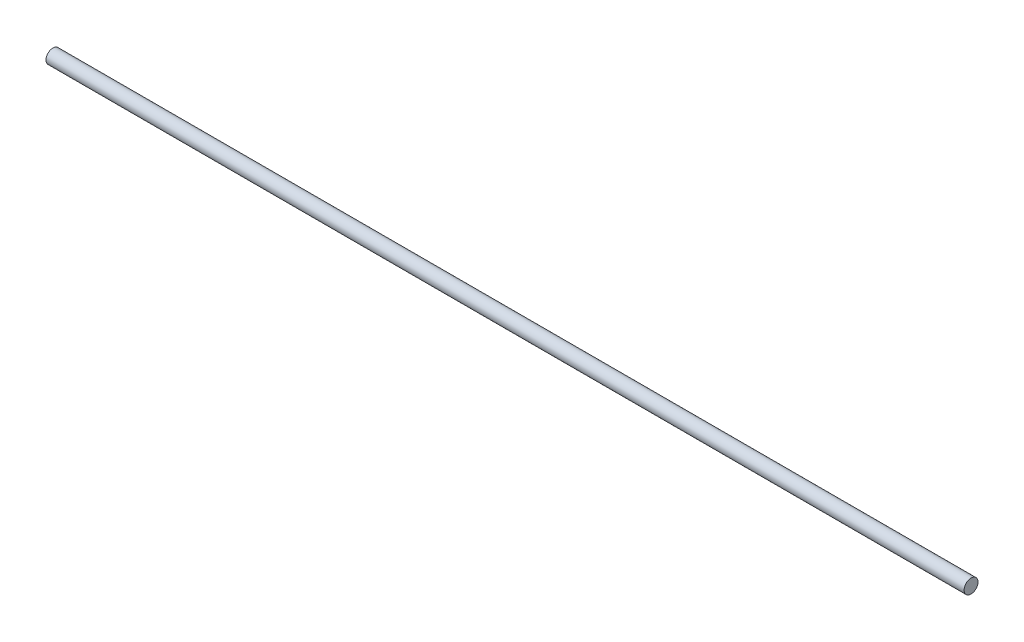
ISO-10303-21;
HEADER;
FILE_DESCRIPTION(('STEP AP214'),'2;1');
FILE_NAME('part.step','',(''),(''),'','','');
FILE_SCHEMA(('AUTOMOTIVE_DESIGN { 1 0 10303 214 1 1 1 1 }'));
ENDSEC;
DATA;
#1=APPLICATION_CONTEXT('core data for automotive mechanical design processes');
#2=APPLICATION_PROTOCOL_DEFINITION('international standard','automotive_design',2000,#1);
#3=PRODUCT_CONTEXT('',#1,'mechanical');
#4=PRODUCT('Part','Part','',(#3));
#5=PRODUCT_RELATED_PRODUCT_CATEGORY('part','',(#4));
#6=PRODUCT_DEFINITION_FORMATION('','',#4);
#7=PRODUCT_DEFINITION_CONTEXT('part definition',#1,'design');
#8=PRODUCT_DEFINITION('design','',#6,#7);
#9=PRODUCT_DEFINITION_SHAPE('','',#8);
#10=(LENGTH_UNIT() NAMED_UNIT(*) SI_UNIT(.MILLI.,.METRE.));
#11=(NAMED_UNIT(*) PLANE_ANGLE_UNIT() SI_UNIT($,.RADIAN.));
#12=(NAMED_UNIT(*) SI_UNIT($,.STERADIAN.) SOLID_ANGLE_UNIT());
#13=UNCERTAINTY_MEASURE_WITH_UNIT(LENGTH_MEASURE(1.E-05),#10,'distance_accuracy_value','');
#14=(GEOMETRIC_REPRESENTATION_CONTEXT(3) GLOBAL_UNCERTAINTY_ASSIGNED_CONTEXT((#13)) GLOBAL_UNIT_ASSIGNED_CONTEXT((#10,
#11,#12)) REPRESENTATION_CONTEXT('',''));
#15=CARTESIAN_POINT('',(0.,0.,0.));
#16=DIRECTION('',(0.,0.,1.));
#17=DIRECTION('',(1.,0.,0.));
#18=AXIS2_PLACEMENT_3D('',#15,#16,#17);
#19=CARTESIAN_POINT('',(-278.062338091003,0.117111756098624,0.));
#20=DIRECTION('',(1.,0.,0.));
#21=DIRECTION('',(0.,0.,-1.));
#22=AXIS2_PLACEMENT_3D('',#19,#20,#21);
#23=CYLINDRICAL_SURFACE('',#22,2.);
#24=CARTESIAN_POINT('',(-278.062338091003,0.117111756098624,0.));
#25=DIRECTION('',(1.,0.,0.));
#26=DIRECTION('',(0.,0.,-1.));
#27=AXIS2_PLACEMENT_3D('',#24,#25,#26);
#28=CIRCLE('',#27,2.);
#29=CARTESIAN_POINT('',(-278.062338091003,0.117111756098624,-2.));
#30=VERTEX_POINT('',#29);
#31=EDGE_CURVE('E10',#30,#30,#28,.T.);
#32=ORIENTED_EDGE('',*,*,#31,.T.);
#33=EDGE_LOOP('',(#32));
#34=FACE_BOUND('',#33,.T.);
#35=CARTESIAN_POINT('',(-14.1743380910033,0.117111756098624,0.));
#36=DIRECTION('',(1.,0.,0.));
#37=DIRECTION('',(0.,0.,-1.));
#38=AXIS2_PLACEMENT_3D('',#35,#36,#37);
#39=CIRCLE('',#38,2.);
#40=CARTESIAN_POINT('',(-14.1743380910033,0.117111756098624,-2.));
#41=VERTEX_POINT('',#40);
#42=EDGE_CURVE('E34',#41,#41,#39,.T.);
#43=ORIENTED_EDGE('',*,*,#42,.F.);
#44=EDGE_LOOP('',(#43));
#45=FACE_BOUND('',#44,.T.);
#46=ADVANCED_FACE('F31',(#34,#45),#23,.T.);
#47=CARTESIAN_POINT('',(-278.062338091003,0.117111756098624,0.));
#48=DIRECTION('',(1.,0.,0.));
#49=DIRECTION('',(0.,0.,-1.));
#50=AXIS2_PLACEMENT_3D('',#47,#48,#49);
#51=PLANE('',#50);
#52=ORIENTED_EDGE('',*,*,#31,.F.);
#53=EDGE_LOOP('',(#52));
#54=FACE_BOUND('',#53,.T.);
#55=ADVANCED_FACE('F46',(#54),#51,.F.);
#56=CARTESIAN_POINT('',(-14.1743380910033,0.117111756098624,0.));
#57=DIRECTION('',(1.,0.,0.));
#58=DIRECTION('',(0.,0.,-1.));
#59=AXIS2_PLACEMENT_3D('',#56,#57,#58);
#60=PLANE('',#59);
#61=ORIENTED_EDGE('',*,*,#42,.T.);
#62=EDGE_LOOP('',(#61));
#63=FACE_BOUND('',#62,.T.);
#64=ADVANCED_FACE('F43',(#63),#60,.T.);
#65=CLOSED_SHELL('',(#46,#55,#64));
#66=MANIFOLD_SOLID_BREP('B2',#65);
#67=ADVANCED_BREP_SHAPE_REPRESENTATION('',(#18,#66),#14);
#68=SHAPE_DEFINITION_REPRESENTATION(#9,#67);
ENDSEC;
END-ISO-10303-21;
